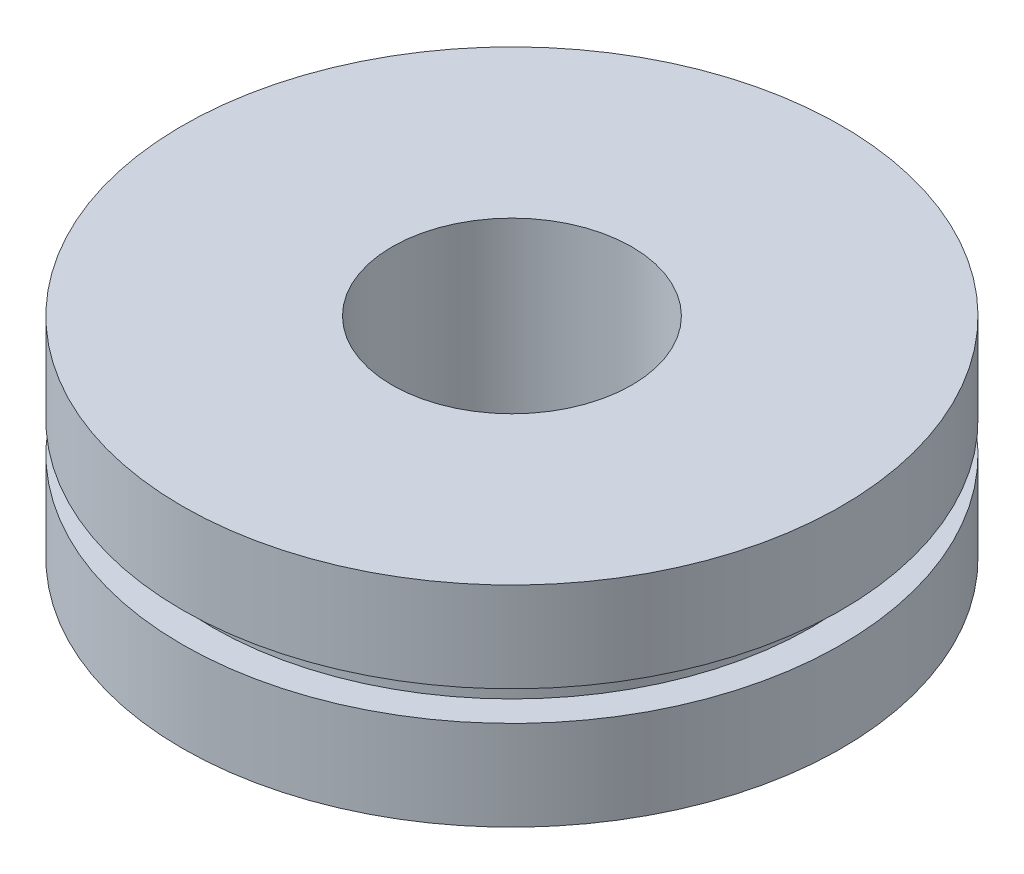
ISO-10303-21;
HEADER;
FILE_DESCRIPTION(('STEP AP214'),'2;1');
FILE_NAME('part.step','',(''),(''),'','','');
FILE_SCHEMA(('AUTOMOTIVE_DESIGN { 1 0 10303 214 1 1 1 1 }'));
ENDSEC;
DATA;
#1=APPLICATION_CONTEXT('core data for automotive mechanical design processes');
#2=APPLICATION_PROTOCOL_DEFINITION('international standard','automotive_design',2000,#1);
#3=PRODUCT_CONTEXT('',#1,'mechanical');
#4=PRODUCT('Part','Part','',(#3));
#5=PRODUCT_RELATED_PRODUCT_CATEGORY('part','',(#4));
#6=PRODUCT_DEFINITION_FORMATION('','',#4);
#7=PRODUCT_DEFINITION_CONTEXT('part definition',#1,'design');
#8=PRODUCT_DEFINITION('design','',#6,#7);
#9=PRODUCT_DEFINITION_SHAPE('','',#8);
#10=(LENGTH_UNIT() NAMED_UNIT(*) SI_UNIT(.MILLI.,.METRE.));
#11=(NAMED_UNIT(*) PLANE_ANGLE_UNIT() SI_UNIT($,.RADIAN.));
#12=(NAMED_UNIT(*) SI_UNIT($,.STERADIAN.) SOLID_ANGLE_UNIT());
#13=UNCERTAINTY_MEASURE_WITH_UNIT(LENGTH_MEASURE(1.E-05),#10,'distance_accuracy_value','');
#14=(GEOMETRIC_REPRESENTATION_CONTEXT(3) GLOBAL_UNCERTAINTY_ASSIGNED_CONTEXT((#13)) GLOBAL_UNIT_ASSIGNED_CONTEXT((#10,
#11,#12)) REPRESENTATION_CONTEXT('',''));
#15=CARTESIAN_POINT('',(0.,0.,0.));
#16=DIRECTION('',(0.,0.,1.));
#17=DIRECTION('',(1.,0.,0.));
#18=AXIS2_PLACEMENT_3D('',#15,#16,#17);
#19=CARTESIAN_POINT('',(0.,7.,0.));
#20=DIRECTION('',(0.,-1.,0.));
#21=DIRECTION('',(0.,0.,-1.));
#22=AXIS2_PLACEMENT_3D('',#19,#20,#21);
#23=CYLINDRICAL_SURFACE('',#22,11.);
#24=CARTESIAN_POINT('',(0.,0.,0.));
#25=DIRECTION('',(0.,1.,0.));
#26=DIRECTION('',(0.,0.,1.));
#27=AXIS2_PLACEMENT_3D('',#24,#25,#26);
#28=CIRCLE('',#27,11.);
#29=CARTESIAN_POINT('',(0.,0.,11.));
#30=VERTEX_POINT('',#29);
#31=EDGE_CURVE('E45',#30,#30,#28,.T.);
#32=ORIENTED_EDGE('',*,*,#31,.T.);
#33=EDGE_LOOP('',(#32));
#34=FACE_BOUND('',#33,.T.);
#35=CARTESIAN_POINT('',(0.,3.,0.));
#36=DIRECTION('',(0.,1.,0.));
#37=DIRECTION('',(0.,0.,1.));
#38=AXIS2_PLACEMENT_3D('',#35,#36,#37);
#39=CIRCLE('',#38,11.);
#40=CARTESIAN_POINT('',(0.,3.,11.));
#41=VERTEX_POINT('',#40);
#42=EDGE_CURVE('E56',#41,#41,#39,.T.);
#43=ORIENTED_EDGE('',*,*,#42,.F.);
#44=EDGE_LOOP('',(#43));
#45=FACE_BOUND('',#44,.T.);
#46=ADVANCED_FACE('F36',(#34,#45),#23,.T.);
#47=CARTESIAN_POINT('',(0.,7.,0.));
#48=DIRECTION('',(0.,1.,0.));
#49=DIRECTION('',(0.,0.,1.));
#50=AXIS2_PLACEMENT_3D('',#47,#48,#49);
#51=PLANE('',#50);
#52=CARTESIAN_POINT('',(0.,7.,0.));
#53=DIRECTION('',(0.,1.,0.));
#54=DIRECTION('',(0.,0.,1.));
#55=AXIS2_PLACEMENT_3D('',#52,#53,#54);
#56=CIRCLE('',#55,11.);
#57=CARTESIAN_POINT('',(0.,7.,11.));
#58=VERTEX_POINT('',#57);
#59=EDGE_CURVE('E10',#58,#58,#56,.T.);
#60=ORIENTED_EDGE('',*,*,#59,.T.);
#61=EDGE_LOOP('',(#60));
#62=FACE_BOUND('',#61,.T.);
#63=CARTESIAN_POINT('',(0.,7.,0.));
#64=DIRECTION('',(0.,1.,0.));
#65=DIRECTION('',(0.,0.,1.));
#66=AXIS2_PLACEMENT_3D('',#63,#64,#65);
#67=CIRCLE('',#66,4.);
#68=CARTESIAN_POINT('',(0.,7.,4.));
#69=VERTEX_POINT('',#68);
#70=EDGE_CURVE('E51',#69,#69,#67,.T.);
#71=ORIENTED_EDGE('',*,*,#70,.F.);
#72=EDGE_LOOP('',(#71));
#73=FACE_BOUND('',#72,.T.);
#74=ADVANCED_FACE('F98',(#62,#73),#51,.T.);
#75=CARTESIAN_POINT('',(0.,0.,0.));
#76=DIRECTION('',(0.,1.,0.));
#77=DIRECTION('',(0.,0.,1.));
#78=AXIS2_PLACEMENT_3D('',#75,#76,#77);
#79=PLANE('',#78);
#80=ORIENTED_EDGE('',*,*,#31,.F.);
#81=EDGE_LOOP('',(#80));
#82=FACE_BOUND('',#81,.T.);
#83=CARTESIAN_POINT('',(0.,0.,0.));
#84=DIRECTION('',(0.,1.,0.));
#85=DIRECTION('',(0.,0.,1.));
#86=AXIS2_PLACEMENT_3D('',#83,#84,#85);
#87=CIRCLE('',#86,4.);
#88=CARTESIAN_POINT('',(0.,0.,4.));
#89=VERTEX_POINT('',#88);
#90=EDGE_CURVE('E54',#89,#89,#87,.T.);
#91=ORIENTED_EDGE('',*,*,#90,.T.);
#92=EDGE_LOOP('',(#91));
#93=FACE_BOUND('',#92,.T.);
#94=ADVANCED_FACE('F81',(#82,#93),#79,.F.);
#95=CARTESIAN_POINT('',(0.,4.,0.));
#96=DIRECTION('',(0.,1.,0.));
#97=DIRECTION('',(0.,0.,1.));
#98=AXIS2_PLACEMENT_3D('',#95,#96,#97);
#99=CIRCLE('',#98,11.);
#100=CARTESIAN_POINT('',(0.,4.,11.));
#101=VERTEX_POINT('',#100);
#102=EDGE_CURVE('E40',#101,#101,#99,.T.);
#103=ORIENTED_EDGE('',*,*,#102,.T.);
#104=EDGE_LOOP('',(#103));
#105=FACE_BOUND('',#104,.T.);
#106=ORIENTED_EDGE('',*,*,#59,.F.);
#107=EDGE_LOOP('',(#106));
#108=FACE_BOUND('',#107,.T.);
#109=ADVANCED_FACE('F38',(#105,#108),#23,.T.);
#110=CARTESIAN_POINT('',(0.,7.,0.));
#111=DIRECTION('',(0.,-1.,0.));
#112=DIRECTION('',(0.,0.,-1.));
#113=AXIS2_PLACEMENT_3D('',#110,#111,#112);
#114=CYLINDRICAL_SURFACE('',#113,4.);
#115=ORIENTED_EDGE('',*,*,#70,.T.);
#116=EDGE_LOOP('',(#115));
#117=FACE_BOUND('',#116,.T.);
#118=ORIENTED_EDGE('',*,*,#90,.F.);
#119=EDGE_LOOP('',(#118));
#120=FACE_BOUND('',#119,.T.);
#121=ADVANCED_FACE('F83',(#117,#120),#114,.F.);
#122=CARTESIAN_POINT('',(0.,4.,0.));
#123=DIRECTION('',(0.,1.,0.));
#124=DIRECTION('',(0.,0.,1.));
#125=AXIS2_PLACEMENT_3D('',#122,#123,#124);
#126=PLANE('',#125);
#127=CARTESIAN_POINT('',(0.,4.,0.));
#128=DIRECTION('',(0.,1.,0.));
#129=DIRECTION('',(0.,0.,1.));
#130=AXIS2_PLACEMENT_3D('',#127,#128,#129);
#131=CIRCLE('',#130,10.);
#132=CARTESIAN_POINT('',(0.,4.,10.));
#133=VERTEX_POINT('',#132);
#134=EDGE_CURVE('E59',#133,#133,#131,.T.);
#135=ORIENTED_EDGE('',*,*,#134,.T.);
#136=EDGE_LOOP('',(#135));
#137=FACE_BOUND('',#136,.T.);
#138=ORIENTED_EDGE('',*,*,#102,.F.);
#139=EDGE_LOOP('',(#138));
#140=FACE_BOUND('',#139,.T.);
#141=ADVANCED_FACE('F85',(#137,#140),#126,.F.);
#142=CARTESIAN_POINT('',(0.,3.,0.));
#143=DIRECTION('',(0.,1.,0.));
#144=DIRECTION('',(0.,0.,1.));
#145=AXIS2_PLACEMENT_3D('',#142,#143,#144);
#146=PLANE('',#145);
#147=CARTESIAN_POINT('',(0.,3.,0.));
#148=DIRECTION('',(0.,1.,0.));
#149=DIRECTION('',(0.,0.,1.));
#150=AXIS2_PLACEMENT_3D('',#147,#148,#149);
#151=CIRCLE('',#150,10.);
#152=CARTESIAN_POINT('',(0.,3.,10.));
#153=VERTEX_POINT('',#152);
#154=EDGE_CURVE('E66',#153,#153,#151,.T.);
#155=ORIENTED_EDGE('',*,*,#154,.F.);
#156=EDGE_LOOP('',(#155));
#157=FACE_BOUND('',#156,.T.);
#158=ORIENTED_EDGE('',*,*,#42,.T.);
#159=EDGE_LOOP('',(#158));
#160=FACE_BOUND('',#159,.T.);
#161=ADVANCED_FACE('F92',(#157,#160),#146,.T.);
#162=CARTESIAN_POINT('',(0.,4.,0.));
#163=DIRECTION('',(0.,-1.,0.));
#164=DIRECTION('',(0.,0.,-1.));
#165=AXIS2_PLACEMENT_3D('',#162,#163,#164);
#166=CYLINDRICAL_SURFACE('',#165,10.);
#167=ORIENTED_EDGE('',*,*,#134,.F.);
#168=EDGE_LOOP('',(#167));
#169=FACE_BOUND('',#168,.T.);
#170=ORIENTED_EDGE('',*,*,#154,.T.);
#171=EDGE_LOOP('',(#170));
#172=FACE_BOUND('',#171,.T.);
#173=ADVANCED_FACE('F130',(#169,#172),#166,.T.);
#174=CLOSED_SHELL('',(#46,#74,#94,#109,#121,#141,#161,#173));
#175=MANIFOLD_SOLID_BREP('B2',#174);
#176=ADVANCED_BREP_SHAPE_REPRESENTATION('',(#18,#175),#14);
#177=SHAPE_DEFINITION_REPRESENTATION(#9,#176);
ENDSEC;
END-ISO-10303-21;
